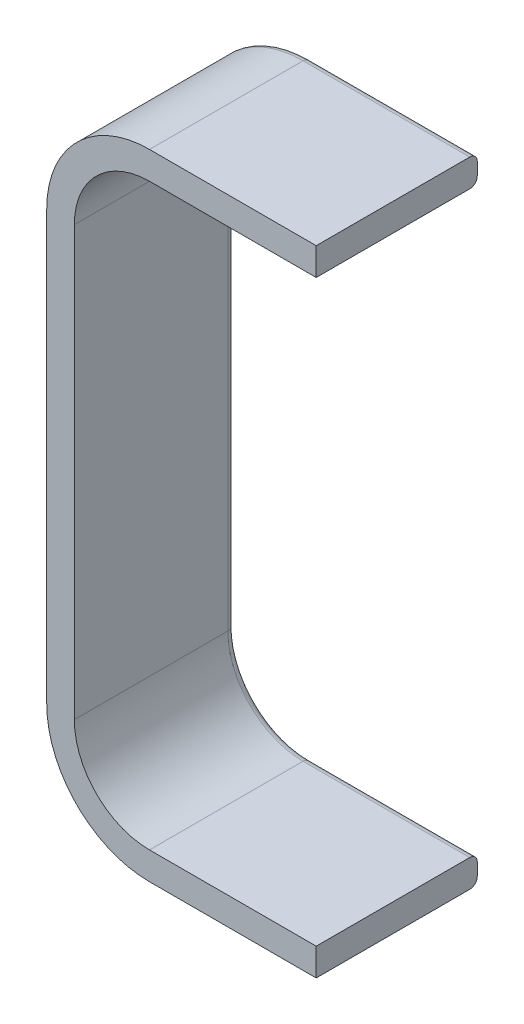
ISO-10303-21;
HEADER;
FILE_DESCRIPTION(('STEP AP214'),'2;1');
FILE_NAME('part.step','',(''),(''),'','','');
FILE_SCHEMA(('AUTOMOTIVE_DESIGN { 1 0 10303 214 1 1 1 1 }'));
ENDSEC;
DATA;
#1=APPLICATION_CONTEXT('core data for automotive mechanical design processes');
#2=APPLICATION_PROTOCOL_DEFINITION('international standard','automotive_design',2000,#1);
#3=PRODUCT_CONTEXT('',#1,'mechanical');
#4=PRODUCT('Part','Part','',(#3));
#5=PRODUCT_RELATED_PRODUCT_CATEGORY('part','',(#4));
#6=PRODUCT_DEFINITION_FORMATION('','',#4);
#7=PRODUCT_DEFINITION_CONTEXT('part definition',#1,'design');
#8=PRODUCT_DEFINITION('design','',#6,#7);
#9=PRODUCT_DEFINITION_SHAPE('','',#8);
#10=(LENGTH_UNIT() NAMED_UNIT(*) SI_UNIT(.MILLI.,.METRE.));
#11=(NAMED_UNIT(*) PLANE_ANGLE_UNIT() SI_UNIT($,.RADIAN.));
#12=(NAMED_UNIT(*) SI_UNIT($,.STERADIAN.) SOLID_ANGLE_UNIT());
#13=UNCERTAINTY_MEASURE_WITH_UNIT(LENGTH_MEASURE(1.E-05),#10,'distance_accuracy_value','');
#14=(GEOMETRIC_REPRESENTATION_CONTEXT(3) GLOBAL_UNCERTAINTY_ASSIGNED_CONTEXT((#13)) GLOBAL_UNIT_ASSIGNED_CONTEXT((#10,
#11,#12)) REPRESENTATION_CONTEXT('',''));
#15=CARTESIAN_POINT('',(0.,0.,0.));
#16=DIRECTION('',(0.,0.,1.));
#17=DIRECTION('',(1.,0.,0.));
#18=AXIS2_PLACEMENT_3D('',#15,#16,#17);
#19=CARTESIAN_POINT('',(-133.00000000004,-82.,-128.5));
#20=DIRECTION('',(0.,0.,1.));
#21=DIRECTION('',(1.,0.,0.));
#22=AXIS2_PLACEMENT_3D('',#19,#20,#21);
#23=CYLINDRICAL_SURFACE('',#22,60.);
#24=DIRECTION('',(0.,0.,1.));
#25=VECTOR('',#24,1.);
#26=CARTESIAN_POINT('',(-193.00000000004,-82.,-128.5));
#27=LINE('',#26,#25);
#28=CARTESIAN_POINT('',(-193.00000000004,-82.,-122.5));
#29=VERTEX_POINT('',#28);
#30=CARTESIAN_POINT('',(-193.00000000004,-82.,0.));
#31=VERTEX_POINT('',#30);
#32=EDGE_CURVE('E223',#29,#31,#27,.T.);
#33=ORIENTED_EDGE('',*,*,#32,.F.);
#34=CARTESIAN_POINT('',(-133.00000000004,-82.,-122.5));
#35=DIRECTION('',(0.,0.,1.));
#36=DIRECTION('',(1.,0.,0.));
#37=AXIS2_PLACEMENT_3D('',#34,#35,#36);
#38=CIRCLE('',#37,60.);
#39=CARTESIAN_POINT('',(-133.,-22.,-122.5));
#40=VERTEX_POINT('',#39);
#41=EDGE_CURVE('E170',#29,#40,#38,.F.);
#42=ORIENTED_EDGE('',*,*,#41,.T.);
#43=DIRECTION('',(0.,0.,1.));
#44=VECTOR('',#43,1.);
#45=CARTESIAN_POINT('',(-133.,-22.,-128.5));
#46=LINE('',#45,#44);
#47=CARTESIAN_POINT('',(-133.,-22.,0.));
#48=VERTEX_POINT('',#47);
#49=EDGE_CURVE('E163',#40,#48,#46,.T.);
#50=ORIENTED_EDGE('',*,*,#49,.T.);
#51=CARTESIAN_POINT('',(-133.00000000004,-82.,0.));
#52=DIRECTION('',(0.,0.,-1.));
#53=DIRECTION('',(1.,0.,0.));
#54=AXIS2_PLACEMENT_3D('',#51,#52,#53);
#55=CIRCLE('',#54,60.);
#56=EDGE_CURVE('E167',#31,#48,#55,.T.);
#57=ORIENTED_EDGE('',*,*,#56,.F.);
#58=EDGE_LOOP('',(#33,#42,#50,#57));
#59=FACE_BOUND('',#58,.T.);
#60=ADVANCED_FACE('F36',(#59),#23,.F.);
#61=CARTESIAN_POINT('',(-193.00000000004,-82.,-128.5));
#62=DIRECTION('',(1.,0.,0.));
#63=DIRECTION('',(0.,1.,0.));
#64=AXIS2_PLACEMENT_3D('',#61,#62,#63);
#65=PLANE('',#64);
#66=DIRECTION('',(0.,0.,1.));
#67=VECTOR('',#66,1.);
#68=CARTESIAN_POINT('',(-193.00000000004,-424.,-128.5));
#69=LINE('',#68,#67);
#70=CARTESIAN_POINT('',(-193.00000000004,-424.,-122.5));
#71=VERTEX_POINT('',#70);
#72=CARTESIAN_POINT('',(-193.00000000004,-424.,0.));
#73=VERTEX_POINT('',#72);
#74=EDGE_CURVE('E226',#71,#73,#69,.T.);
#75=ORIENTED_EDGE('',*,*,#74,.F.);
#76=DIRECTION('',(0.,1.,0.));
#77=VECTOR('',#76,1.);
#78=CARTESIAN_POINT('',(-193.00000000004,-82.,-122.5));
#79=LINE('',#78,#77);
#80=EDGE_CURVE('E278',#71,#29,#79,.T.);
#81=ORIENTED_EDGE('',*,*,#80,.T.);
#82=ORIENTED_EDGE('',*,*,#32,.T.);
#83=DIRECTION('',(0.,1.,0.));
#84=VECTOR('',#83,1.);
#85=CARTESIAN_POINT('',(-193.00000000004,-82.,0.));
#86=LINE('',#85,#84);
#87=EDGE_CURVE('E188',#73,#31,#86,.T.);
#88=ORIENTED_EDGE('',*,*,#87,.F.);
#89=EDGE_LOOP('',(#75,#81,#82,#88));
#90=FACE_BOUND('',#89,.T.);
#91=ADVANCED_FACE('F370',(#90),#65,.T.);
#92=CARTESIAN_POINT('',(-133.00000000004,-424.,-128.5));
#93=DIRECTION('',(0.,0.,1.));
#94=DIRECTION('',(1.,0.,0.));
#95=AXIS2_PLACEMENT_3D('',#92,#93,#94);
#96=CYLINDRICAL_SURFACE('',#95,60.);
#97=DIRECTION('',(0.,0.,1.));
#98=VECTOR('',#97,1.);
#99=CARTESIAN_POINT('',(-133.00000000004,-484.,-128.5));
#100=LINE('',#99,#98);
#101=CARTESIAN_POINT('',(-133.00000000004,-484.,-122.5));
#102=VERTEX_POINT('',#101);
#103=CARTESIAN_POINT('',(-133.00000000004,-484.,0.));
#104=VERTEX_POINT('',#103);
#105=EDGE_CURVE('E228',#102,#104,#100,.T.);
#106=ORIENTED_EDGE('',*,*,#105,.F.);
#107=CARTESIAN_POINT('',(-133.00000000004,-424.,-122.5));
#108=DIRECTION('',(0.,0.,1.));
#109=DIRECTION('',(1.,0.,0.));
#110=AXIS2_PLACEMENT_3D('',#107,#108,#109);
#111=CIRCLE('',#110,60.);
#112=EDGE_CURVE('E45',#102,#71,#111,.F.);
#113=ORIENTED_EDGE('',*,*,#112,.T.);
#114=ORIENTED_EDGE('',*,*,#74,.T.);
#115=CARTESIAN_POINT('',(-133.00000000004,-424.,0.));
#116=DIRECTION('',(0.,0.,-1.));
#117=DIRECTION('',(1.,0.,0.));
#118=AXIS2_PLACEMENT_3D('',#115,#116,#117);
#119=CIRCLE('',#118,60.);
#120=EDGE_CURVE('E219',#104,#73,#119,.T.);
#121=ORIENTED_EDGE('',*,*,#120,.F.);
#122=EDGE_LOOP('',(#106,#113,#114,#121));
#123=FACE_BOUND('',#122,.T.);
#124=ADVANCED_FACE('F367',(#123),#96,.F.);
#125=CARTESIAN_POINT('',(0.,-484.,-128.5));
#126=DIRECTION('',(0.,1.,0.));
#127=DIRECTION('',(-1.,0.,0.));
#128=AXIS2_PLACEMENT_3D('',#125,#126,#127);
#129=PLANE('',#128);
#130=DIRECTION('',(0.,0.,1.));
#131=VECTOR('',#130,1.);
#132=CARTESIAN_POINT('',(0.,-484.,-128.5));
#133=LINE('',#132,#131);
#134=CARTESIAN_POINT('',(0.,-484.,-122.5));
#135=VERTEX_POINT('',#134);
#136=CARTESIAN_POINT('',(0.,-484.,0.));
#137=VERTEX_POINT('',#136);
#138=EDGE_CURVE('E230',#135,#137,#133,.T.);
#139=ORIENTED_EDGE('',*,*,#138,.F.);
#140=DIRECTION('',(-1.,0.,0.));
#141=VECTOR('',#140,1.);
#142=CARTESIAN_POINT('',(-133.00000000004,-484.,-122.5));
#143=LINE('',#142,#141);
#144=EDGE_CURVE('E225',#135,#102,#143,.T.);
#145=ORIENTED_EDGE('',*,*,#144,.T.);
#146=ORIENTED_EDGE('',*,*,#105,.T.);
#147=DIRECTION('',(-1.,0.,0.));
#148=VECTOR('',#147,1.);
#149=CARTESIAN_POINT('',(0.,-484.,0.));
#150=LINE('',#149,#148);
#151=EDGE_CURVE('E216',#137,#104,#150,.T.);
#152=ORIENTED_EDGE('',*,*,#151,.F.);
#153=EDGE_LOOP('',(#139,#145,#146,#152));
#154=FACE_BOUND('',#153,.T.);
#155=ADVANCED_FACE('F364',(#154),#129,.T.);
#156=CARTESIAN_POINT('',(0.,-506.,-128.5));
#157=DIRECTION('',(1.,0.,0.));
#158=DIRECTION('',(0.,1.,0.));
#159=AXIS2_PLACEMENT_3D('',#156,#157,#158);
#160=PLANE('',#159);
#161=DIRECTION('',(0.,1.,0.));
#162=VECTOR('',#161,1.);
#163=CARTESIAN_POINT('',(0.,-506.,-128.5));
#164=LINE('',#163,#162);
#165=CARTESIAN_POINT('',(0.,-500.,-128.5));
#166=VERTEX_POINT('',#165);
#167=CARTESIAN_POINT('',(0.,-490.,-128.5));
#168=VERTEX_POINT('',#167);
#169=EDGE_CURVE('E174',#166,#168,#164,.T.);
#170=ORIENTED_EDGE('',*,*,#169,.T.);
#171=CARTESIAN_POINT('',(0.,-490.,-122.5));
#172=DIRECTION('',(1.,0.,0.));
#173=DIRECTION('',(0.,1.,0.));
#174=AXIS2_PLACEMENT_3D('',#171,#172,#173);
#175=CIRCLE('',#174,6.);
#176=EDGE_CURVE('E269',#168,#135,#175,.T.);
#177=ORIENTED_EDGE('',*,*,#176,.T.);
#178=ORIENTED_EDGE('',*,*,#138,.T.);
#179=DIRECTION('',(0.,1.,0.));
#180=VECTOR('',#179,1.);
#181=CARTESIAN_POINT('',(0.,-506.,0.));
#182=LINE('',#181,#180);
#183=CARTESIAN_POINT('',(0.,-506.,0.));
#184=VERTEX_POINT('',#183);
#185=EDGE_CURVE('E213',#184,#137,#182,.T.);
#186=ORIENTED_EDGE('',*,*,#185,.F.);
#187=DIRECTION('',(0.,0.,1.));
#188=VECTOR('',#187,1.);
#189=CARTESIAN_POINT('',(0.,-506.,-128.5));
#190=LINE('',#189,#188);
#191=CARTESIAN_POINT('',(0.,-506.,-122.5));
#192=VERTEX_POINT('',#191);
#193=EDGE_CURVE('E232',#192,#184,#190,.T.);
#194=ORIENTED_EDGE('',*,*,#193,.F.);
#195=CARTESIAN_POINT('',(0.,-500.,-122.5));
#196=DIRECTION('',(1.,0.,0.));
#197=DIRECTION('',(0.,1.,0.));
#198=AXIS2_PLACEMENT_3D('',#195,#196,#197);
#199=CIRCLE('',#198,6.);
#200=EDGE_CURVE('E267',#192,#166,#199,.T.);
#201=ORIENTED_EDGE('',*,*,#200,.T.);
#202=EDGE_LOOP('',(#170,#177,#178,#186,#194,#201));
#203=FACE_BOUND('',#202,.T.);
#204=ADVANCED_FACE('F320',(#203),#160,.T.);
#205=CARTESIAN_POINT('',(-133.00000000004,-506.,-128.5));
#206=DIRECTION('',(0.,-1.,0.));
#207=DIRECTION('',(0.,0.,-1.));
#208=AXIS2_PLACEMENT_3D('',#205,#206,#207);
#209=PLANE('',#208);
#210=DIRECTION('',(0.,0.,1.));
#211=VECTOR('',#210,1.);
#212=CARTESIAN_POINT('',(-133.00000000004,-506.,-128.5));
#213=LINE('',#212,#211);
#214=CARTESIAN_POINT('',(-133.00000000004,-506.,-122.5));
#215=VERTEX_POINT('',#214);
#216=CARTESIAN_POINT('',(-133.00000000004,-506.,0.));
#217=VERTEX_POINT('',#216);
#218=EDGE_CURVE('E234',#215,#217,#213,.T.);
#219=ORIENTED_EDGE('',*,*,#218,.F.);
#220=DIRECTION('',(1.,0.,0.));
#221=VECTOR('',#220,1.);
#222=CARTESIAN_POINT('',(0.,-506.,-122.5));
#223=LINE('',#222,#221);
#224=EDGE_CURVE('E11',#215,#192,#223,.T.);
#225=ORIENTED_EDGE('',*,*,#224,.T.);
#226=ORIENTED_EDGE('',*,*,#193,.T.);
#227=DIRECTION('',(1.,0.,0.));
#228=VECTOR('',#227,1.);
#229=CARTESIAN_POINT('',(-133.00000000004,-506.,0.));
#230=LINE('',#229,#228);
#231=EDGE_CURVE('E210',#217,#184,#230,.T.);
#232=ORIENTED_EDGE('',*,*,#231,.F.);
#233=EDGE_LOOP('',(#219,#225,#226,#232));
#234=FACE_BOUND('',#233,.T.);
#235=ADVANCED_FACE('F315',(#234),#209,.T.);
#236=CARTESIAN_POINT('',(-133.00000000004,-424.,-128.5));
#237=DIRECTION('',(0.,0.,1.));
#238=DIRECTION('',(1.,0.,0.));
#239=AXIS2_PLACEMENT_3D('',#236,#237,#238);
#240=CYLINDRICAL_SURFACE('',#239,81.9999999999999);
#241=DIRECTION('',(0.,0.,1.));
#242=VECTOR('',#241,1.);
#243=CARTESIAN_POINT('',(-215.00000000004,-424.,-128.5));
#244=LINE('',#243,#242);
#245=CARTESIAN_POINT('',(-215.00000000004,-424.,-122.5));
#246=VERTEX_POINT('',#245);
#247=CARTESIAN_POINT('',(-215.00000000004,-424.,0.));
#248=VERTEX_POINT('',#247);
#249=EDGE_CURVE('E236',#246,#248,#244,.T.);
#250=ORIENTED_EDGE('',*,*,#249,.F.);
#251=CARTESIAN_POINT('',(-133.00000000004,-424.,-122.5));
#252=DIRECTION('',(0.,0.,1.));
#253=DIRECTION('',(1.,0.,0.));
#254=AXIS2_PLACEMENT_3D('',#251,#252,#253);
#255=CIRCLE('',#254,81.9999999999999);
#256=EDGE_CURVE('E53',#246,#215,#255,.T.);
#257=ORIENTED_EDGE('',*,*,#256,.T.);
#258=ORIENTED_EDGE('',*,*,#218,.T.);
#259=CARTESIAN_POINT('',(-133.00000000004,-424.,0.));
#260=DIRECTION('',(0.,0.,1.));
#261=DIRECTION('',(1.,0.,0.));
#262=AXIS2_PLACEMENT_3D('',#259,#260,#261);
#263=CIRCLE('',#262,81.9999999999999);
#264=EDGE_CURVE('E207',#248,#217,#263,.T.);
#265=ORIENTED_EDGE('',*,*,#264,.F.);
#266=EDGE_LOOP('',(#250,#257,#258,#265));
#267=FACE_BOUND('',#266,.T.);
#268=ADVANCED_FACE('F326',(#267),#240,.T.);
#269=CARTESIAN_POINT('',(-215.00000000004,-82.,-128.5));
#270=DIRECTION('',(-1.,0.,0.));
#271=DIRECTION('',(0.,-1.,0.));
#272=AXIS2_PLACEMENT_3D('',#269,#270,#271);
#273=PLANE('',#272);
#274=DIRECTION('',(0.,0.,1.));
#275=VECTOR('',#274,1.);
#276=CARTESIAN_POINT('',(-215.00000000004,-82.,-128.5));
#277=LINE('',#276,#275);
#278=CARTESIAN_POINT('',(-215.00000000004,-82.,-122.5));
#279=VERTEX_POINT('',#278);
#280=CARTESIAN_POINT('',(-215.00000000004,-82.,0.));
#281=VERTEX_POINT('',#280);
#282=EDGE_CURVE('E238',#279,#281,#277,.T.);
#283=ORIENTED_EDGE('',*,*,#282,.F.);
#284=DIRECTION('',(0.,-1.,0.));
#285=VECTOR('',#284,1.);
#286=CARTESIAN_POINT('',(-215.00000000004,-424.,-122.5));
#287=LINE('',#286,#285);
#288=EDGE_CURVE('E61',#279,#246,#287,.T.);
#289=ORIENTED_EDGE('',*,*,#288,.T.);
#290=ORIENTED_EDGE('',*,*,#249,.T.);
#291=DIRECTION('',(0.,-1.,0.));
#292=VECTOR('',#291,1.);
#293=CARTESIAN_POINT('',(-215.00000000004,-82.,0.));
#294=LINE('',#293,#292);
#295=EDGE_CURVE('E204',#281,#248,#294,.T.);
#296=ORIENTED_EDGE('',*,*,#295,.F.);
#297=EDGE_LOOP('',(#283,#289,#290,#296));
#298=FACE_BOUND('',#297,.T.);
#299=ADVANCED_FACE('F327',(#298),#273,.T.);
#300=CARTESIAN_POINT('',(-133.00000000004,-82.,-128.5));
#301=DIRECTION('',(0.,0.,1.));
#302=DIRECTION('',(1.,0.,0.));
#303=AXIS2_PLACEMENT_3D('',#300,#301,#302);
#304=CYLINDRICAL_SURFACE('',#303,82.);
#305=DIRECTION('',(0.,0.,1.));
#306=VECTOR('',#305,1.);
#307=CARTESIAN_POINT('',(-133.00000000004,0.,-128.5));
#308=LINE('',#307,#306);
#309=CARTESIAN_POINT('',(-133.00000000004,0.,-122.5));
#310=VERTEX_POINT('',#309);
#311=CARTESIAN_POINT('',(-133.00000000004,0.,0.));
#312=VERTEX_POINT('',#311);
#313=EDGE_CURVE('E240',#310,#312,#308,.T.);
#314=ORIENTED_EDGE('',*,*,#313,.F.);
#315=CARTESIAN_POINT('',(-133.00000000004,-82.,-122.5));
#316=DIRECTION('',(0.,0.,1.));
#317=DIRECTION('',(1.,0.,0.));
#318=AXIS2_PLACEMENT_3D('',#315,#316,#317);
#319=CIRCLE('',#318,82.);
#320=EDGE_CURVE('E283',#310,#279,#319,.T.);
#321=ORIENTED_EDGE('',*,*,#320,.T.);
#322=ORIENTED_EDGE('',*,*,#282,.T.);
#323=CARTESIAN_POINT('',(-133.00000000004,-82.,0.));
#324=DIRECTION('',(0.,0.,1.));
#325=DIRECTION('',(-1.,0.,0.));
#326=AXIS2_PLACEMENT_3D('',#323,#324,#325);
#327=CIRCLE('',#326,82.);
#328=EDGE_CURVE('E201',#312,#281,#327,.T.);
#329=ORIENTED_EDGE('',*,*,#328,.F.);
#330=EDGE_LOOP('',(#314,#321,#322,#329));
#331=FACE_BOUND('',#330,.T.);
#332=ADVANCED_FACE('F332',(#331),#304,.T.);
#333=CARTESIAN_POINT('',(0.,0.,-128.5));
#334=DIRECTION('',(0.,1.,0.));
#335=DIRECTION('',(-1.,0.,0.));
#336=AXIS2_PLACEMENT_3D('',#333,#334,#335);
#337=PLANE('',#336);
#338=DIRECTION('',(0.,0.,1.));
#339=VECTOR('',#338,1.);
#340=CARTESIAN_POINT('',(0.,0.,-128.5));
#341=LINE('',#340,#339);
#342=CARTESIAN_POINT('',(0.,0.,-122.5));
#343=VERTEX_POINT('',#342);
#344=CARTESIAN_POINT('',(0.,0.,0.));
#345=VERTEX_POINT('',#344);
#346=EDGE_CURVE('E242',#343,#345,#341,.T.);
#347=ORIENTED_EDGE('',*,*,#346,.F.);
#348=DIRECTION('',(-1.,0.,0.));
#349=VECTOR('',#348,1.);
#350=CARTESIAN_POINT('',(-133.00000000004,0.,-122.5));
#351=LINE('',#350,#349);
#352=EDGE_CURVE('E280',#343,#310,#351,.T.);
#353=ORIENTED_EDGE('',*,*,#352,.T.);
#354=ORIENTED_EDGE('',*,*,#313,.T.);
#355=DIRECTION('',(-1.,0.,0.));
#356=VECTOR('',#355,1.);
#357=CARTESIAN_POINT('',(0.,0.,0.));
#358=LINE('',#357,#356);
#359=EDGE_CURVE('E198',#345,#312,#358,.T.);
#360=ORIENTED_EDGE('',*,*,#359,.F.);
#361=EDGE_LOOP('',(#347,#353,#354,#360));
#362=FACE_BOUND('',#361,.T.);
#363=ADVANCED_FACE('F342',(#362),#337,.T.);
#364=CARTESIAN_POINT('',(0.,-22.,-128.5));
#365=DIRECTION('',(1.,0.,0.));
#366=DIRECTION('',(0.,0.,-1.));
#367=AXIS2_PLACEMENT_3D('',#364,#365,#366);
#368=PLANE('',#367);
#369=DIRECTION('',(0.,0.,1.));
#370=VECTOR('',#369,1.);
#371=CARTESIAN_POINT('',(0.,-22.,-128.5));
#372=LINE('',#371,#370);
#373=CARTESIAN_POINT('',(0.,-22.,-122.5));
#374=VERTEX_POINT('',#373);
#375=CARTESIAN_POINT('',(0.,-22.,0.));
#376=VERTEX_POINT('',#375);
#377=EDGE_CURVE('E173',#374,#376,#372,.T.);
#378=ORIENTED_EDGE('',*,*,#377,.F.);
#379=CARTESIAN_POINT('',(0.,-16.,-122.5));
#380=DIRECTION('',(1.,0.,0.));
#381=DIRECTION('',(0.,0.,-1.));
#382=AXIS2_PLACEMENT_3D('',#379,#380,#381);
#383=CIRCLE('',#382,6.);
#384=CARTESIAN_POINT('',(0.,-16.,-128.5));
#385=VERTEX_POINT('',#384);
#386=EDGE_CURVE('E275',#374,#385,#383,.T.);
#387=ORIENTED_EDGE('',*,*,#386,.T.);
#388=DIRECTION('',(0.,1.,0.));
#389=VECTOR('',#388,1.);
#390=CARTESIAN_POINT('',(0.,-22.,-128.5));
#391=LINE('',#390,#389);
#392=CARTESIAN_POINT('',(0.,-6.,-128.5));
#393=VERTEX_POINT('',#392);
#394=EDGE_CURVE('E222',#385,#393,#391,.T.);
#395=ORIENTED_EDGE('',*,*,#394,.T.);
#396=CARTESIAN_POINT('',(0.,-6.,-122.5));
#397=DIRECTION('',(1.,0.,0.));
#398=DIRECTION('',(0.,0.,-1.));
#399=AXIS2_PLACEMENT_3D('',#396,#397,#398);
#400=CIRCLE('',#399,6.);
#401=EDGE_CURVE('E273',#393,#343,#400,.T.);
#402=ORIENTED_EDGE('',*,*,#401,.T.);
#403=ORIENTED_EDGE('',*,*,#346,.T.);
#404=DIRECTION('',(0.,1.,0.));
#405=VECTOR('',#404,1.);
#406=CARTESIAN_POINT('',(0.,-22.,0.));
#407=LINE('',#406,#405);
#408=EDGE_CURVE('E183',#376,#345,#407,.T.);
#409=ORIENTED_EDGE('',*,*,#408,.F.);
#410=EDGE_LOOP('',(#378,#387,#395,#402,#403,#409));
#411=FACE_BOUND('',#410,.T.);
#412=ADVANCED_FACE('F353',(#411),#368,.T.);
#413=CARTESIAN_POINT('',(-133.,-22.,-128.5));
#414=DIRECTION('',(0.,-1.,0.));
#415=DIRECTION('',(0.,0.,-1.));
#416=AXIS2_PLACEMENT_3D('',#413,#414,#415);
#417=PLANE('',#416);
#418=ORIENTED_EDGE('',*,*,#49,.F.);
#419=DIRECTION('',(1.,0.,0.));
#420=VECTOR('',#419,1.);
#421=CARTESIAN_POINT('',(0.,-22.,-122.5));
#422=LINE('',#421,#420);
#423=EDGE_CURVE('E271',#40,#374,#422,.T.);
#424=ORIENTED_EDGE('',*,*,#423,.T.);
#425=ORIENTED_EDGE('',*,*,#377,.T.);
#426=DIRECTION('',(1.,0.,0.));
#427=VECTOR('',#426,1.);
#428=CARTESIAN_POINT('',(-133.,-22.,0.));
#429=LINE('',#428,#427);
#430=EDGE_CURVE('E177',#48,#376,#429,.T.);
#431=ORIENTED_EDGE('',*,*,#430,.F.);
#432=EDGE_LOOP('',(#418,#424,#425,#431));
#433=FACE_BOUND('',#432,.T.);
#434=ADVANCED_FACE('F178',(#433),#417,.T.);
#435=CARTESIAN_POINT('',(-133.00000000004,-82.,-128.5));
#436=DIRECTION('',(0.,0.,1.));
#437=DIRECTION('',(1.,0.,0.));
#438=AXIS2_PLACEMENT_3D('',#435,#436,#437);
#439=PLANE('',#438);
#440=CARTESIAN_POINT('',(-133.00000000004,-424.,-128.5));
#441=DIRECTION('',(0.,0.,1.));
#442=DIRECTION('',(1.,0.,0.));
#443=AXIS2_PLACEMENT_3D('',#440,#441,#442);
#444=CIRCLE('',#443,66.);
#445=CARTESIAN_POINT('',(-199.00000000004,-424.,-128.5));
#446=VERTEX_POINT('',#445);
#447=CARTESIAN_POINT('',(-133.00000000004,-490.,-128.5));
#448=VERTEX_POINT('',#447);
#449=EDGE_CURVE('E257',#446,#448,#444,.T.);
#450=ORIENTED_EDGE('',*,*,#449,.T.);
#451=DIRECTION('',(-1.,0.,0.));
#452=VECTOR('',#451,1.);
#453=CARTESIAN_POINT('',(0.,-490.,-128.5));
#454=LINE('',#453,#452);
#455=EDGE_CURVE('E265',#448,#168,#454,.F.);
#456=ORIENTED_EDGE('',*,*,#455,.T.);
#457=ORIENTED_EDGE('',*,*,#169,.F.);
#458=DIRECTION('',(1.,0.,0.));
#459=VECTOR('',#458,1.);
#460=CARTESIAN_POINT('',(-133.00000000004,-500.,-128.5));
#461=LINE('',#460,#459);
#462=CARTESIAN_POINT('',(-133.00000000004,-500.,-128.5));
#463=VERTEX_POINT('',#462);
#464=EDGE_CURVE('E247',#166,#463,#461,.F.);
#465=ORIENTED_EDGE('',*,*,#464,.T.);
#466=CARTESIAN_POINT('',(-133.00000000004,-424.,-128.5));
#467=DIRECTION('',(0.,0.,1.));
#468=DIRECTION('',(1.,0.,0.));
#469=AXIS2_PLACEMENT_3D('',#466,#467,#468);
#470=CIRCLE('',#469,75.9999999999999);
#471=CARTESIAN_POINT('',(-209.00000000004,-424.,-128.5));
#472=VERTEX_POINT('',#471);
#473=EDGE_CURVE('E249',#463,#472,#470,.F.);
#474=ORIENTED_EDGE('',*,*,#473,.T.);
#475=DIRECTION('',(0.,-1.,0.));
#476=VECTOR('',#475,1.);
#477=CARTESIAN_POINT('',(-209.00000000004,-82.,-128.5));
#478=LINE('',#477,#476);
#479=CARTESIAN_POINT('',(-209.00000000004,-82.,-128.5));
#480=VERTEX_POINT('',#479);
#481=EDGE_CURVE('E251',#472,#480,#478,.F.);
#482=ORIENTED_EDGE('',*,*,#481,.T.);
#483=CARTESIAN_POINT('',(-133.00000000004,-82.,-128.5));
#484=DIRECTION('',(0.,0.,1.));
#485=DIRECTION('',(1.,0.,0.));
#486=AXIS2_PLACEMENT_3D('',#483,#484,#485);
#487=CIRCLE('',#486,76.);
#488=CARTESIAN_POINT('',(-133.00000000004,-6.00000000000001,-128.5));
#489=VERTEX_POINT('',#488);
#490=EDGE_CURVE('E253',#480,#489,#487,.F.);
#491=ORIENTED_EDGE('',*,*,#490,.T.);
#492=DIRECTION('',(-1.,0.,0.));
#493=VECTOR('',#492,1.);
#494=CARTESIAN_POINT('',(0.,-6.,-128.5));
#495=LINE('',#494,#493);
#496=EDGE_CURVE('E255',#489,#393,#495,.F.);
#497=ORIENTED_EDGE('',*,*,#496,.T.);
#498=ORIENTED_EDGE('',*,*,#394,.F.);
#499=DIRECTION('',(1.,0.,0.));
#500=VECTOR('',#499,1.);
#501=CARTESIAN_POINT('',(-133.,-16.,-128.5));
#502=LINE('',#501,#500);
#503=CARTESIAN_POINT('',(-133.,-16.,-128.5));
#504=VERTEX_POINT('',#503);
#505=EDGE_CURVE('E263',#385,#504,#502,.F.);
#506=ORIENTED_EDGE('',*,*,#505,.T.);
#507=CARTESIAN_POINT('',(-133.00000000004,-82.,-128.5));
#508=DIRECTION('',(0.,0.,1.));
#509=DIRECTION('',(1.,0.,0.));
#510=AXIS2_PLACEMENT_3D('',#507,#508,#509);
#511=CIRCLE('',#510,66.);
#512=CARTESIAN_POINT('',(-199.00000000004,-82.,-128.5));
#513=VERTEX_POINT('',#512);
#514=EDGE_CURVE('E261',#504,#513,#511,.T.);
#515=ORIENTED_EDGE('',*,*,#514,.T.);
#516=DIRECTION('',(0.,1.,0.));
#517=VECTOR('',#516,1.);
#518=CARTESIAN_POINT('',(-199.00000000004,-424.,-128.5));
#519=LINE('',#518,#517);
#520=EDGE_CURVE('E259',#513,#446,#519,.F.);
#521=ORIENTED_EDGE('',*,*,#520,.T.);
#522=EDGE_LOOP('',(#450,#456,#457,#465,#474,#482,#491,#497,#498,#506,#515,#521));
#523=FACE_BOUND('',#522,.T.);
#524=ADVANCED_FACE('F350',(#523),#439,.F.);
#525=CARTESIAN_POINT('',(-133.00000000004,-82.,0.));
#526=DIRECTION('',(0.,0.,1.));
#527=DIRECTION('',(1.,0.,0.));
#528=AXIS2_PLACEMENT_3D('',#525,#526,#527);
#529=PLANE('',#528);
#530=ORIENTED_EDGE('',*,*,#56,.T.);
#531=ORIENTED_EDGE('',*,*,#430,.T.);
#532=ORIENTED_EDGE('',*,*,#408,.T.);
#533=ORIENTED_EDGE('',*,*,#359,.T.);
#534=ORIENTED_EDGE('',*,*,#328,.T.);
#535=ORIENTED_EDGE('',*,*,#295,.T.);
#536=ORIENTED_EDGE('',*,*,#264,.T.);
#537=ORIENTED_EDGE('',*,*,#231,.T.);
#538=ORIENTED_EDGE('',*,*,#185,.T.);
#539=ORIENTED_EDGE('',*,*,#151,.T.);
#540=ORIENTED_EDGE('',*,*,#120,.T.);
#541=ORIENTED_EDGE('',*,*,#87,.T.);
#542=EDGE_LOOP('',(#530,#531,#532,#533,#534,#535,#536,#537,#538,#539,#540,#541));
#543=FACE_BOUND('',#542,.T.);
#544=ADVANCED_FACE('F185',(#543),#529,.T.);
#545=CARTESIAN_POINT('',(-133.,-16.,-122.5));
#546=DIRECTION('',(-1.,0.,0.));
#547=DIRECTION('',(0.,0.,1.));
#548=AXIS2_PLACEMENT_3D('',#545,#546,#547);
#549=CYLINDRICAL_SURFACE('',#548,6.);
#550=ORIENTED_EDGE('',*,*,#386,.F.);
#551=ORIENTED_EDGE('',*,*,#423,.F.);
#552=CARTESIAN_POINT('',(-133.,-16.,-122.5));
#553=DIRECTION('',(-1.,0.,0.));
#554=DIRECTION('',(0.,0.,1.));
#555=AXIS2_PLACEMENT_3D('',#552,#553,#554);
#556=CIRCLE('',#555,6.);
#557=EDGE_CURVE('E189',#504,#40,#556,.T.);
#558=ORIENTED_EDGE('',*,*,#557,.F.);
#559=ORIENTED_EDGE('',*,*,#505,.F.);
#560=EDGE_LOOP('',(#550,#551,#558,#559));
#561=FACE_BOUND('',#560,.T.);
#562=ADVANCED_FACE('F383',(#561),#549,.T.);
#563=CARTESIAN_POINT('',(-133.00000000004,-82.,-122.5));
#564=DIRECTION('',(0.,0.,1.));
#565=DIRECTION('',(1.,0.,0.));
#566=AXIS2_PLACEMENT_3D('',#563,#564,#565);
#567=TOROIDAL_SURFACE('',#566,66.,6.);
#568=ORIENTED_EDGE('',*,*,#557,.T.);
#569=ORIENTED_EDGE('',*,*,#41,.F.);
#570=CARTESIAN_POINT('',(-199.00000000004,-82.,-122.5));
#571=DIRECTION('',(0.,-1.,0.));
#572=DIRECTION('',(0.,0.,-1.));
#573=AXIS2_PLACEMENT_3D('',#570,#571,#572);
#574=CIRCLE('',#573,6.);
#575=EDGE_CURVE('E192',#513,#29,#574,.T.);
#576=ORIENTED_EDGE('',*,*,#575,.F.);
#577=ORIENTED_EDGE('',*,*,#514,.F.);
#578=EDGE_LOOP('',(#568,#569,#576,#577));
#579=FACE_BOUND('',#578,.T.);
#580=ADVANCED_FACE('F374',(#579),#567,.T.);
#581=CARTESIAN_POINT('',(-199.00000000004,-82.,-122.5));
#582=DIRECTION('',(0.,-1.,0.));
#583=DIRECTION('',(1.,0.,0.));
#584=AXIS2_PLACEMENT_3D('',#581,#582,#583);
#585=CYLINDRICAL_SURFACE('',#584,6.);
#586=ORIENTED_EDGE('',*,*,#575,.T.);
#587=ORIENTED_EDGE('',*,*,#80,.F.);
#588=CARTESIAN_POINT('',(-199.00000000004,-424.,-122.5));
#589=DIRECTION('',(0.,-1.,0.));
#590=DIRECTION('',(0.,0.,-1.));
#591=AXIS2_PLACEMENT_3D('',#588,#589,#590);
#592=CIRCLE('',#591,6.);
#593=EDGE_CURVE('E290',#446,#71,#592,.T.);
#594=ORIENTED_EDGE('',*,*,#593,.F.);
#595=ORIENTED_EDGE('',*,*,#520,.F.);
#596=EDGE_LOOP('',(#586,#587,#594,#595));
#597=FACE_BOUND('',#596,.T.);
#598=ADVANCED_FACE('F379',(#597),#585,.T.);
#599=CARTESIAN_POINT('',(-133.00000000004,-424.,-122.5));
#600=DIRECTION('',(0.,0.,1.));
#601=DIRECTION('',(1.,0.,0.));
#602=AXIS2_PLACEMENT_3D('',#599,#600,#601);
#603=TOROIDAL_SURFACE('',#602,66.,6.);
#604=ORIENTED_EDGE('',*,*,#593,.T.);
#605=ORIENTED_EDGE('',*,*,#112,.F.);
#606=CARTESIAN_POINT('',(-133.00000000004,-490.,-122.5));
#607=DIRECTION('',(1.,0.,0.));
#608=DIRECTION('',(0.,0.,-1.));
#609=AXIS2_PLACEMENT_3D('',#606,#607,#608);
#610=CIRCLE('',#609,6.);
#611=EDGE_CURVE('E288',#448,#102,#610,.T.);
#612=ORIENTED_EDGE('',*,*,#611,.F.);
#613=ORIENTED_EDGE('',*,*,#449,.F.);
#614=EDGE_LOOP('',(#604,#605,#612,#613));
#615=FACE_BOUND('',#614,.T.);
#616=ADVANCED_FACE('F404',(#615),#603,.T.);
#617=CARTESIAN_POINT('',(0.,-490.,-122.5));
#618=DIRECTION('',(1.,0.,0.));
#619=DIRECTION('',(0.,1.,0.));
#620=AXIS2_PLACEMENT_3D('',#617,#618,#619);
#621=CYLINDRICAL_SURFACE('',#620,6.);
#622=ORIENTED_EDGE('',*,*,#176,.F.);
#623=ORIENTED_EDGE('',*,*,#455,.F.);
#624=ORIENTED_EDGE('',*,*,#611,.T.);
#625=ORIENTED_EDGE('',*,*,#144,.F.);
#626=EDGE_LOOP('',(#622,#623,#624,#625));
#627=FACE_BOUND('',#626,.T.);
#628=ADVANCED_FACE('F359',(#627),#621,.T.);
#629=CARTESIAN_POINT('',(-133.00000000004,-500.,-122.5));
#630=DIRECTION('',(-1.,0.,0.));
#631=DIRECTION('',(0.,0.,1.));
#632=AXIS2_PLACEMENT_3D('',#629,#630,#631);
#633=CYLINDRICAL_SURFACE('',#632,6.);
#634=ORIENTED_EDGE('',*,*,#200,.F.);
#635=ORIENTED_EDGE('',*,*,#224,.F.);
#636=CARTESIAN_POINT('',(-133.00000000004,-500.,-122.5));
#637=DIRECTION('',(-1.,0.,0.));
#638=DIRECTION('',(0.,0.,1.));
#639=AXIS2_PLACEMENT_3D('',#636,#637,#638);
#640=CIRCLE('',#639,6.);
#641=EDGE_CURVE('E40',#463,#215,#640,.T.);
#642=ORIENTED_EDGE('',*,*,#641,.F.);
#643=ORIENTED_EDGE('',*,*,#464,.F.);
#644=EDGE_LOOP('',(#634,#635,#642,#643));
#645=FACE_BOUND('',#644,.T.);
#646=ADVANCED_FACE('F38',(#645),#633,.T.);
#647=CARTESIAN_POINT('',(-133.00000000004,-424.,-122.5));
#648=DIRECTION('',(0.,0.,1.));
#649=DIRECTION('',(1.,0.,0.));
#650=AXIS2_PLACEMENT_3D('',#647,#648,#649);
#651=TOROIDAL_SURFACE('',#650,75.9999999999999,6.);
#652=ORIENTED_EDGE('',*,*,#641,.T.);
#653=ORIENTED_EDGE('',*,*,#256,.F.);
#654=CARTESIAN_POINT('',(-209.00000000004,-424.,-122.5));
#655=DIRECTION('',(0.,1.,0.));
#656=DIRECTION('',(0.,0.,1.));
#657=AXIS2_PLACEMENT_3D('',#654,#655,#656);
#658=CIRCLE('',#657,6.);
#659=EDGE_CURVE('E299',#472,#246,#658,.T.);
#660=ORIENTED_EDGE('',*,*,#659,.F.);
#661=ORIENTED_EDGE('',*,*,#473,.F.);
#662=EDGE_LOOP('',(#652,#653,#660,#661));
#663=FACE_BOUND('',#662,.T.);
#664=ADVANCED_FACE('F308',(#663),#651,.T.);
#665=CARTESIAN_POINT('',(-209.00000000004,-82.,-122.5));
#666=DIRECTION('',(0.,1.,0.));
#667=DIRECTION('',(-1.,0.,0.));
#668=AXIS2_PLACEMENT_3D('',#665,#666,#667);
#669=CYLINDRICAL_SURFACE('',#668,6.);
#670=ORIENTED_EDGE('',*,*,#659,.T.);
#671=ORIENTED_EDGE('',*,*,#288,.F.);
#672=CARTESIAN_POINT('',(-209.00000000004,-82.,-122.5));
#673=DIRECTION('',(0.,1.,0.));
#674=DIRECTION('',(0.,0.,1.));
#675=AXIS2_PLACEMENT_3D('',#672,#673,#674);
#676=CIRCLE('',#675,6.);
#677=EDGE_CURVE('E297',#480,#279,#676,.T.);
#678=ORIENTED_EDGE('',*,*,#677,.F.);
#679=ORIENTED_EDGE('',*,*,#481,.F.);
#680=EDGE_LOOP('',(#670,#671,#678,#679));
#681=FACE_BOUND('',#680,.T.);
#682=ADVANCED_FACE('F432',(#681),#669,.T.);
#683=CARTESIAN_POINT('',(-133.00000000004,-82.,-122.5));
#684=DIRECTION('',(0.,0.,1.));
#685=DIRECTION('',(1.,0.,0.));
#686=AXIS2_PLACEMENT_3D('',#683,#684,#685);
#687=TOROIDAL_SURFACE('',#686,76.,6.);
#688=ORIENTED_EDGE('',*,*,#677,.T.);
#689=ORIENTED_EDGE('',*,*,#320,.F.);
#690=CARTESIAN_POINT('',(-133.00000000004,-6.00000000000001,-122.5));
#691=DIRECTION('',(1.,0.,0.));
#692=DIRECTION('',(0.,0.,-1.));
#693=AXIS2_PLACEMENT_3D('',#690,#691,#692);
#694=CIRCLE('',#693,6.);
#695=EDGE_CURVE('E295',#489,#310,#694,.T.);
#696=ORIENTED_EDGE('',*,*,#695,.F.);
#697=ORIENTED_EDGE('',*,*,#490,.F.);
#698=EDGE_LOOP('',(#688,#689,#696,#697));
#699=FACE_BOUND('',#698,.T.);
#700=ADVANCED_FACE('F336',(#699),#687,.T.);
#701=CARTESIAN_POINT('',(0.,-6.,-122.5));
#702=DIRECTION('',(1.,0.,0.));
#703=DIRECTION('',(0.,1.,0.));
#704=AXIS2_PLACEMENT_3D('',#701,#702,#703);
#705=CYLINDRICAL_SURFACE('',#704,6.);
#706=ORIENTED_EDGE('',*,*,#401,.F.);
#707=ORIENTED_EDGE('',*,*,#496,.F.);
#708=ORIENTED_EDGE('',*,*,#695,.T.);
#709=ORIENTED_EDGE('',*,*,#352,.F.);
#710=EDGE_LOOP('',(#706,#707,#708,#709));
#711=FACE_BOUND('',#710,.T.);
#712=ADVANCED_FACE('F345',(#711),#705,.T.);
#713=CLOSED_SHELL('',(#60,#91,#124,#155,#204,#235,#268,#299,#332,#363,#412,#434,#524,#544,#562,
#580,#598,#616,#628,#646,#664,#682,#700,#712));
#714=MANIFOLD_SOLID_BREP('B2',#713);
#715=ADVANCED_BREP_SHAPE_REPRESENTATION('',(#18,#714),#14);
#716=SHAPE_DEFINITION_REPRESENTATION(#9,#715);
ENDSEC;
END-ISO-10303-21;
